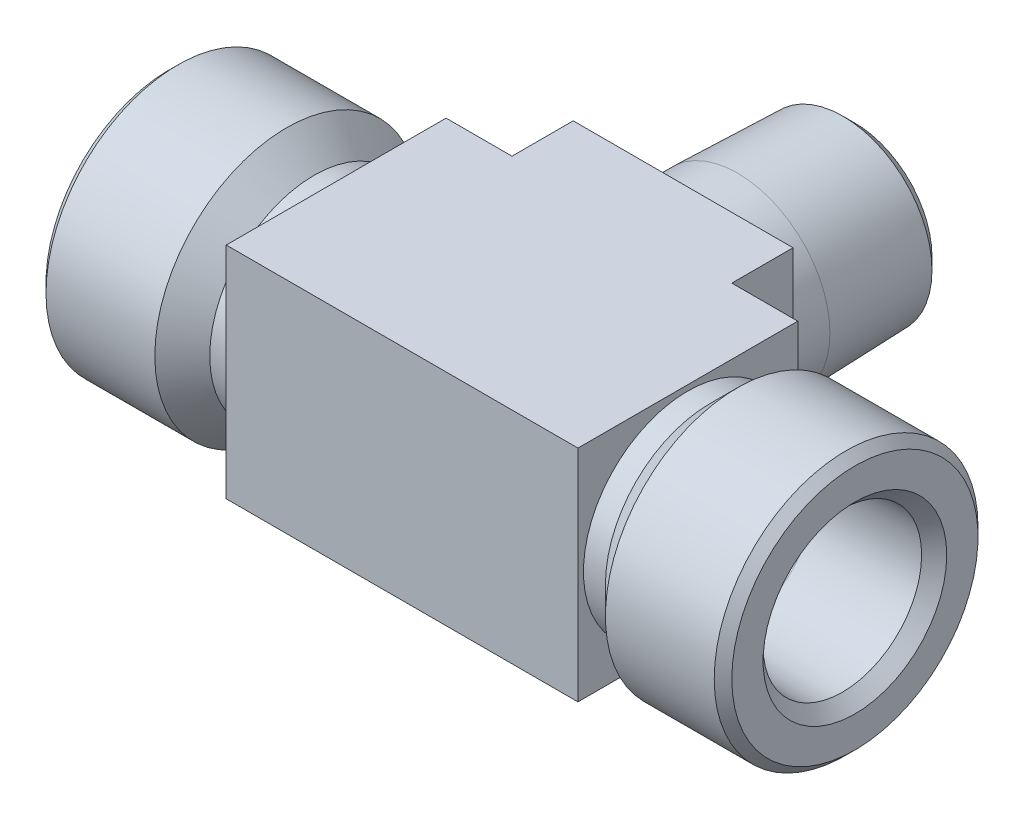
ISO-10303-21;
HEADER;
FILE_DESCRIPTION(('STEP AP214'),'2;1');
FILE_NAME('part.step','',(''),(''),'','','');
FILE_SCHEMA(('AUTOMOTIVE_DESIGN { 1 0 10303 214 1 1 1 1 }'));
ENDSEC;
DATA;
#1=APPLICATION_CONTEXT('core data for automotive mechanical design processes');
#2=APPLICATION_PROTOCOL_DEFINITION('international standard','automotive_design',2000,#1);
#3=PRODUCT_CONTEXT('',#1,'mechanical');
#4=PRODUCT('Part','Part','',(#3));
#5=PRODUCT_RELATED_PRODUCT_CATEGORY('part','',(#4));
#6=PRODUCT_DEFINITION_FORMATION('','',#4);
#7=PRODUCT_DEFINITION_CONTEXT('part definition',#1,'design');
#8=PRODUCT_DEFINITION('design','',#6,#7);
#9=PRODUCT_DEFINITION_SHAPE('','',#8);
#10=(LENGTH_UNIT() NAMED_UNIT(*) SI_UNIT(.MILLI.,.METRE.));
#11=(NAMED_UNIT(*) PLANE_ANGLE_UNIT() SI_UNIT($,.RADIAN.));
#12=(NAMED_UNIT(*) SI_UNIT($,.STERADIAN.) SOLID_ANGLE_UNIT());
#13=UNCERTAINTY_MEASURE_WITH_UNIT(LENGTH_MEASURE(1.E-05),#10,'distance_accuracy_value','');
#14=(GEOMETRIC_REPRESENTATION_CONTEXT(3) GLOBAL_UNCERTAINTY_ASSIGNED_CONTEXT((#13)) GLOBAL_UNIT_ASSIGNED_CONTEXT((#10,
#11,#12)) REPRESENTATION_CONTEXT('',''));
#15=CARTESIAN_POINT('',(0.,0.,0.));
#16=DIRECTION('',(0.,0.,1.));
#17=DIRECTION('',(1.,0.,0.));
#18=AXIS2_PLACEMENT_3D('',#15,#16,#17);
#19=CARTESIAN_POINT('',(19.304,12.7,-12.7));
#20=DIRECTION('',(0.,0.,-1.));
#21=DIRECTION('',(-1.,0.,0.));
#22=AXIS2_PLACEMENT_3D('',#19,#20,#21);
#23=PLANE('',#22);
#24=DIRECTION('',(0.,1.,0.));
#25=VECTOR('',#24,1.);
#26=CARTESIAN_POINT('',(19.304,0.,-12.7));
#27=LINE('',#26,#25);
#28=CARTESIAN_POINT('',(19.304,12.7,-12.7));
#29=VERTEX_POINT('',#28);
#30=CARTESIAN_POINT('',(19.304,-12.7,-12.7));
#31=VERTEX_POINT('',#30);
#32=EDGE_CURVE('E123',#29,#31,#27,.F.);
#33=ORIENTED_EDGE('',*,*,#32,.F.);
#34=DIRECTION('',(1.,0.,0.));
#35=VECTOR('',#34,1.);
#36=CARTESIAN_POINT('',(19.304,12.7,-12.7));
#37=LINE('',#36,#35);
#38=CARTESIAN_POINT('',(26.924,12.7,-12.7));
#39=VERTEX_POINT('',#38);
#40=EDGE_CURVE('E207',#39,#29,#37,.F.);
#41=ORIENTED_EDGE('',*,*,#40,.F.);
#42=DIRECTION('',(0.,1.,0.));
#43=VECTOR('',#42,1.);
#44=CARTESIAN_POINT('',(26.924,12.7,-12.7));
#45=LINE('',#44,#43);
#46=CARTESIAN_POINT('',(26.924,-12.7,-12.7));
#47=VERTEX_POINT('',#46);
#48=EDGE_CURVE('E209',#47,#39,#45,.T.);
#49=ORIENTED_EDGE('',*,*,#48,.F.);
#50=DIRECTION('',(1.,0.,0.));
#51=VECTOR('',#50,1.);
#52=CARTESIAN_POINT('',(19.304,-12.7,-12.7));
#53=LINE('',#52,#51);
#54=EDGE_CURVE('E214',#31,#47,#53,.T.);
#55=ORIENTED_EDGE('',*,*,#54,.F.);
#56=EDGE_LOOP('',(#33,#41,#49,#55));
#57=FACE_BOUND('',#56,.T.);
#58=ADVANCED_FACE('F16',(#57),#23,.T.);
#59=CARTESIAN_POINT('',(19.304,0.,-6.35));
#60=DIRECTION('',(-1.,0.,0.));
#61=DIRECTION('',(0.,0.,1.));
#62=AXIS2_PLACEMENT_3D('',#59,#60,#61);
#63=PLANE('',#62);
#64=DIRECTION('',(0.,0.,1.));
#65=VECTOR('',#64,1.);
#66=CARTESIAN_POINT('',(19.304,12.7,12.7));
#67=LINE('',#66,#65);
#68=CARTESIAN_POINT('',(19.304,12.7,12.7));
#69=VERTEX_POINT('',#68);
#70=EDGE_CURVE('E205',#29,#69,#67,.T.);
#71=ORIENTED_EDGE('',*,*,#70,.F.);
#72=ORIENTED_EDGE('',*,*,#32,.T.);
#73=DIRECTION('',(0.,0.,1.));
#74=VECTOR('',#73,1.);
#75=CARTESIAN_POINT('',(19.304,-12.7,-12.7));
#76=LINE('',#75,#74);
#77=CARTESIAN_POINT('',(19.304,-12.7,12.7));
#78=VERTEX_POINT('',#77);
#79=EDGE_CURVE('E108',#78,#31,#76,.F.);
#80=ORIENTED_EDGE('',*,*,#79,.F.);
#81=DIRECTION('',(0.,-1.,0.));
#82=VECTOR('',#81,1.);
#83=CARTESIAN_POINT('',(19.304,-12.7,12.7));
#84=LINE('',#83,#82);
#85=EDGE_CURVE('E121',#69,#78,#84,.T.);
#86=ORIENTED_EDGE('',*,*,#85,.F.);
#87=EDGE_LOOP('',(#71,#72,#80,#86));
#88=FACE_BOUND('',#87,.T.);
#89=CARTESIAN_POINT('',(19.304,0.,0.));
#90=DIRECTION('',(-1.,0.,0.));
#91=DIRECTION('',(0.,0.,1.));
#92=AXIS2_PLACEMENT_3D('',#89,#90,#91);
#93=CIRCLE('',#92,12.065);
#94=CARTESIAN_POINT('',(19.304,0.,12.065));
#95=VERTEX_POINT('',#94);
#96=EDGE_CURVE('E102',#95,#95,#93,.T.);
#97=ORIENTED_EDGE('',*,*,#96,.F.);
#98=EDGE_LOOP('',(#97));
#99=FACE_BOUND('',#98,.T.);
#100=ADVANCED_FACE('F278',(#88,#99),#63,.T.);
#101=CARTESIAN_POINT('',(19.304,-12.7,12.7));
#102=DIRECTION('',(0.,0.,1.));
#103=DIRECTION('',(0.,-1.,0.));
#104=AXIS2_PLACEMENT_3D('',#101,#102,#103);
#105=PLANE('',#104);
#106=DIRECTION('',(0.,1.,0.));
#107=VECTOR('',#106,1.);
#108=CARTESIAN_POINT('',(59.944,0.,12.7));
#109=LINE('',#108,#107);
#110=CARTESIAN_POINT('',(59.944,12.7,12.7));
#111=VERTEX_POINT('',#110);
#112=CARTESIAN_POINT('',(59.944,-12.7,12.7));
#113=VERTEX_POINT('',#112);
#114=EDGE_CURVE('E79',#111,#113,#109,.F.);
#115=ORIENTED_EDGE('',*,*,#114,.F.);
#116=DIRECTION('',(1.,0.,0.));
#117=VECTOR('',#116,1.);
#118=CARTESIAN_POINT('',(19.304,12.7,12.7));
#119=LINE('',#118,#117);
#120=EDGE_CURVE('E203',#69,#111,#119,.T.);
#121=ORIENTED_EDGE('',*,*,#120,.F.);
#122=ORIENTED_EDGE('',*,*,#85,.T.);
#123=DIRECTION('',(1.,0.,0.));
#124=VECTOR('',#123,1.);
#125=CARTESIAN_POINT('',(19.304,-12.7,12.7));
#126=LINE('',#125,#124);
#127=EDGE_CURVE('E106',#113,#78,#126,.F.);
#128=ORIENTED_EDGE('',*,*,#127,.F.);
#129=EDGE_LOOP('',(#115,#121,#122,#128));
#130=FACE_BOUND('',#129,.T.);
#131=ADVANCED_FACE('F276',(#130),#105,.T.);
#132=CARTESIAN_POINT('',(59.944,0.,-6.35));
#133=DIRECTION('',(1.,0.,0.));
#134=DIRECTION('',(0.,1.,0.));
#135=AXIS2_PLACEMENT_3D('',#132,#133,#134);
#136=PLANE('',#135);
#137=DIRECTION('',(0.,0.,1.));
#138=VECTOR('',#137,1.);
#139=CARTESIAN_POINT('',(59.944,-12.7,-12.7));
#140=LINE('',#139,#138);
#141=CARTESIAN_POINT('',(59.944,-12.7,-12.7));
#142=VERTEX_POINT('',#141);
#143=EDGE_CURVE('E98',#142,#113,#140,.T.);
#144=ORIENTED_EDGE('',*,*,#143,.F.);
#145=DIRECTION('',(0.,1.,0.));
#146=VECTOR('',#145,1.);
#147=CARTESIAN_POINT('',(59.944,12.7,-12.7));
#148=LINE('',#147,#146);
#149=CARTESIAN_POINT('',(59.944,12.7,-12.7));
#150=VERTEX_POINT('',#149);
#151=EDGE_CURVE('E86',#150,#142,#148,.F.);
#152=ORIENTED_EDGE('',*,*,#151,.F.);
#153=DIRECTION('',(0.,0.,1.));
#154=VECTOR('',#153,1.);
#155=CARTESIAN_POINT('',(59.944,12.7,12.7));
#156=LINE('',#155,#154);
#157=EDGE_CURVE('E201',#111,#150,#156,.F.);
#158=ORIENTED_EDGE('',*,*,#157,.F.);
#159=ORIENTED_EDGE('',*,*,#114,.T.);
#160=EDGE_LOOP('',(#144,#152,#158,#159));
#161=FACE_BOUND('',#160,.T.);
#162=CARTESIAN_POINT('',(59.944,0.,0.));
#163=DIRECTION('',(1.,0.,0.));
#164=DIRECTION('',(0.,0.,-1.));
#165=AXIS2_PLACEMENT_3D('',#162,#163,#164);
#166=CIRCLE('',#165,12.065);
#167=CARTESIAN_POINT('',(59.944,0.,-12.065));
#168=VERTEX_POINT('',#167);
#169=EDGE_CURVE('E19',#168,#168,#166,.T.);
#170=ORIENTED_EDGE('',*,*,#169,.F.);
#171=EDGE_LOOP('',(#170));
#172=FACE_BOUND('',#171,.T.);
#173=ADVANCED_FACE('F104',(#161,#172),#136,.T.);
#174=CARTESIAN_POINT('',(19.304,12.7,-12.7));
#175=DIRECTION('',(0.,0.,-1.));
#176=DIRECTION('',(-1.,0.,0.));
#177=AXIS2_PLACEMENT_3D('',#174,#175,#176);
#178=PLANE('',#177);
#179=ORIENTED_EDGE('',*,*,#151,.T.);
#180=DIRECTION('',(1.,0.,0.));
#181=VECTOR('',#180,1.);
#182=CARTESIAN_POINT('',(19.304,-12.7,-12.7));
#183=LINE('',#182,#181);
#184=CARTESIAN_POINT('',(52.324,-12.7,-12.7));
#185=VERTEX_POINT('',#184);
#186=EDGE_CURVE('E90',#185,#142,#183,.T.);
#187=ORIENTED_EDGE('',*,*,#186,.F.);
#188=DIRECTION('',(0.,1.,0.));
#189=VECTOR('',#188,1.);
#190=CARTESIAN_POINT('',(52.324,-12.7,-12.7));
#191=LINE('',#190,#189);
#192=CARTESIAN_POINT('',(52.324,12.7,-12.7));
#193=VERTEX_POINT('',#192);
#194=EDGE_CURVE('E195',#193,#185,#191,.F.);
#195=ORIENTED_EDGE('',*,*,#194,.F.);
#196=DIRECTION('',(1.,0.,0.));
#197=VECTOR('',#196,1.);
#198=CARTESIAN_POINT('',(19.304,12.7,-12.7));
#199=LINE('',#198,#197);
#200=EDGE_CURVE('E92',#150,#193,#199,.F.);
#201=ORIENTED_EDGE('',*,*,#200,.F.);
#202=EDGE_LOOP('',(#179,#187,#195,#201));
#203=FACE_BOUND('',#202,.T.);
#204=ADVANCED_FACE('F88',(#203),#178,.T.);
#205=CARTESIAN_POINT('',(61.214,0.,0.));
#206=DIRECTION('',(1.,0.,0.));
#207=DIRECTION('',(0.,0.,-1.));
#208=AXIS2_PLACEMENT_3D('',#205,#206,#207);
#209=CYLINDRICAL_SURFACE('',#208,12.065);
#210=ORIENTED_EDGE('',*,*,#169,.T.);
#211=EDGE_LOOP('',(#210));
#212=FACE_BOUND('',#211,.T.);
#213=CARTESIAN_POINT('',(62.484,0.,0.));
#214=DIRECTION('',(1.,0.,0.));
#215=DIRECTION('',(0.,0.,1.));
#216=AXIS2_PLACEMENT_3D('',#213,#214,#215);
#217=CIRCLE('',#216,12.065);
#218=CARTESIAN_POINT('',(62.484,0.,12.065));
#219=VERTEX_POINT('',#218);
#220=EDGE_CURVE('E116',#219,#219,#217,.F.);
#221=ORIENTED_EDGE('',*,*,#220,.T.);
#222=EDGE_LOOP('',(#221));
#223=FACE_BOUND('',#222,.T.);
#224=ADVANCED_FACE('F267',(#212,#223),#209,.T.);
#225=CARTESIAN_POINT('',(18.034,0.,0.));
#226=DIRECTION('',(-1.,0.,0.));
#227=DIRECTION('',(0.,0.,1.));
#228=AXIS2_PLACEMENT_3D('',#225,#226,#227);
#229=CYLINDRICAL_SURFACE('',#228,12.065);
#230=ORIENTED_EDGE('',*,*,#96,.T.);
#231=EDGE_LOOP('',(#230));
#232=FACE_BOUND('',#231,.T.);
#233=CARTESIAN_POINT('',(16.764,0.,0.));
#234=DIRECTION('',(-1.,0.,0.));
#235=DIRECTION('',(0.,0.,-1.));
#236=AXIS2_PLACEMENT_3D('',#233,#234,#235);
#237=CIRCLE('',#236,12.065);
#238=CARTESIAN_POINT('',(16.764,0.,-12.065));
#239=VERTEX_POINT('',#238);
#240=EDGE_CURVE('E112',#239,#239,#237,.F.);
#241=ORIENTED_EDGE('',*,*,#240,.T.);
#242=EDGE_LOOP('',(#241));
#243=FACE_BOUND('',#242,.T.);
#244=ADVANCED_FACE('F264',(#232,#243),#229,.T.);
#245=CARTESIAN_POINT('',(19.304,-12.7,-12.7));
#246=DIRECTION('',(0.,-1.,0.));
#247=DIRECTION('',(1.,0.,0.));
#248=AXIS2_PLACEMENT_3D('',#245,#246,#247);
#249=PLANE('',#248);
#250=ORIENTED_EDGE('',*,*,#79,.T.);
#251=ORIENTED_EDGE('',*,*,#54,.T.);
#252=DIRECTION('',(0.,0.,1.));
#253=VECTOR('',#252,1.);
#254=CARTESIAN_POINT('',(26.924,-12.7,0.));
#255=LINE('',#254,#253);
#256=CARTESIAN_POINT('',(26.924,-12.7,-19.7739));
#257=VERTEX_POINT('',#256);
#258=EDGE_CURVE('E211',#257,#47,#255,.T.);
#259=ORIENTED_EDGE('',*,*,#258,.F.);
#260=DIRECTION('',(-1.,0.,0.));
#261=VECTOR('',#260,1.);
#262=CARTESIAN_POINT('',(45.974,-12.7,-19.7739));
#263=LINE('',#262,#261);
#264=CARTESIAN_POINT('',(52.324,-12.7,-19.7739));
#265=VERTEX_POINT('',#264);
#266=EDGE_CURVE('E115',#265,#257,#263,.T.);
#267=ORIENTED_EDGE('',*,*,#266,.F.);
#268=DIRECTION('',(0.,0.,-1.));
#269=VECTOR('',#268,1.);
#270=CARTESIAN_POINT('',(52.324,-12.7,0.));
#271=LINE('',#270,#269);
#272=EDGE_CURVE('E101',#185,#265,#271,.T.);
#273=ORIENTED_EDGE('',*,*,#272,.F.);
#274=ORIENTED_EDGE('',*,*,#186,.T.);
#275=ORIENTED_EDGE('',*,*,#143,.T.);
#276=ORIENTED_EDGE('',*,*,#127,.T.);
#277=EDGE_LOOP('',(#250,#251,#259,#267,#273,#274,#275,#276));
#278=FACE_BOUND('',#277,.T.);
#279=ADVANCED_FACE('F96',(#278),#249,.T.);
#280=CARTESIAN_POINT('',(26.924,12.7,0.));
#281=DIRECTION('',(-1.,0.,0.));
#282=DIRECTION('',(0.,0.,1.));
#283=AXIS2_PLACEMENT_3D('',#280,#281,#282);
#284=PLANE('',#283);
#285=ORIENTED_EDGE('',*,*,#48,.T.);
#286=DIRECTION('',(0.,0.,1.));
#287=VECTOR('',#286,1.);
#288=CARTESIAN_POINT('',(26.924,12.7,12.7));
#289=LINE('',#288,#287);
#290=CARTESIAN_POINT('',(26.924,12.7,-19.7739));
#291=VERTEX_POINT('',#290);
#292=EDGE_CURVE('E197',#291,#39,#289,.T.);
#293=ORIENTED_EDGE('',*,*,#292,.F.);
#294=DIRECTION('',(0.,1.,0.));
#295=VECTOR('',#294,1.);
#296=CARTESIAN_POINT('',(26.924,0.,-19.7739));
#297=LINE('',#296,#295);
#298=EDGE_CURVE('E184',#257,#291,#297,.T.);
#299=ORIENTED_EDGE('',*,*,#298,.F.);
#300=ORIENTED_EDGE('',*,*,#258,.T.);
#301=EDGE_LOOP('',(#285,#293,#299,#300));
#302=FACE_BOUND('',#301,.T.);
#303=ADVANCED_FACE('F227',(#302),#284,.T.);
#304=CARTESIAN_POINT('',(19.304,12.7,12.7));
#305=DIRECTION('',(0.,1.,0.));
#306=DIRECTION('',(0.,0.,1.));
#307=AXIS2_PLACEMENT_3D('',#304,#305,#306);
#308=PLANE('',#307);
#309=DIRECTION('',(-1.,0.,0.));
#310=VECTOR('',#309,1.);
#311=CARTESIAN_POINT('',(45.974,12.7,-19.7739));
#312=LINE('',#311,#310);
#313=CARTESIAN_POINT('',(52.324,12.7,-19.7739));
#314=VERTEX_POINT('',#313);
#315=EDGE_CURVE('E34',#291,#314,#312,.F.);
#316=ORIENTED_EDGE('',*,*,#315,.F.);
#317=ORIENTED_EDGE('',*,*,#292,.T.);
#318=ORIENTED_EDGE('',*,*,#40,.T.);
#319=ORIENTED_EDGE('',*,*,#70,.T.);
#320=ORIENTED_EDGE('',*,*,#120,.T.);
#321=ORIENTED_EDGE('',*,*,#157,.T.);
#322=ORIENTED_EDGE('',*,*,#200,.T.);
#323=DIRECTION('',(0.,0.,-1.));
#324=VECTOR('',#323,1.);
#325=CARTESIAN_POINT('',(52.324,12.7,0.));
#326=LINE('',#325,#324);
#327=EDGE_CURVE('E118',#314,#193,#326,.F.);
#328=ORIENTED_EDGE('',*,*,#327,.F.);
#329=EDGE_LOOP('',(#316,#317,#318,#319,#320,#321,#322,#328));
#330=FACE_BOUND('',#329,.T.);
#331=ADVANCED_FACE('F230',(#330),#308,.T.);
#332=CARTESIAN_POINT('',(52.324,-12.7,0.));
#333=DIRECTION('',(1.,0.,0.));
#334=DIRECTION('',(0.,0.,-1.));
#335=AXIS2_PLACEMENT_3D('',#332,#333,#334);
#336=PLANE('',#335);
#337=DIRECTION('',(0.,1.,0.));
#338=VECTOR('',#337,1.);
#339=CARTESIAN_POINT('',(52.324,0.,-19.7739));
#340=LINE('',#339,#338);
#341=EDGE_CURVE('E180',#314,#265,#340,.F.);
#342=ORIENTED_EDGE('',*,*,#341,.F.);
#343=ORIENTED_EDGE('',*,*,#327,.T.);
#344=ORIENTED_EDGE('',*,*,#194,.T.);
#345=ORIENTED_EDGE('',*,*,#272,.T.);
#346=EDGE_LOOP('',(#342,#343,#344,#345));
#347=FACE_BOUND('',#346,.T.);
#348=ADVANCED_FACE('F233',(#347),#336,.T.);
#349=CARTESIAN_POINT('',(62.484,0.,0.));
#350=DIRECTION('',(1.,0.,0.));
#351=DIRECTION('',(0.,1.,0.));
#352=AXIS2_PLACEMENT_3D('',#349,#350,#351);
#353=CONICAL_SURFACE('',#352,12.065,0.785398163397448);
#354=ORIENTED_EDGE('',*,*,#220,.F.);
#355=EDGE_LOOP('',(#354));
#356=FACE_BOUND('',#355,.T.);
#357=CARTESIAN_POINT('',(65.659,0.,0.));
#358=DIRECTION('',(1.,0.,0.));
#359=DIRECTION('',(0.,0.,-1.));
#360=AXIS2_PLACEMENT_3D('',#357,#358,#359);
#361=CIRCLE('',#360,15.24);
#362=CARTESIAN_POINT('',(65.659,0.,-15.24));
#363=VERTEX_POINT('',#362);
#364=EDGE_CURVE('E182',#363,#363,#361,.T.);
#365=ORIENTED_EDGE('',*,*,#364,.F.);
#366=EDGE_LOOP('',(#365));
#367=FACE_BOUND('',#366,.T.);
#368=ADVANCED_FACE('F247',(#356,#367),#353,.T.);
#369=CARTESIAN_POINT('',(16.764,0.,0.));
#370=DIRECTION('',(-1.,0.,0.));
#371=DIRECTION('',(0.,0.,1.));
#372=AXIS2_PLACEMENT_3D('',#369,#370,#371);
#373=CONICAL_SURFACE('',#372,12.065,0.785398163397448);
#374=ORIENTED_EDGE('',*,*,#240,.F.);
#375=EDGE_LOOP('',(#374));
#376=FACE_BOUND('',#375,.T.);
#377=CARTESIAN_POINT('',(13.589,0.,0.));
#378=DIRECTION('',(-1.,0.,0.));
#379=DIRECTION('',(0.,0.,1.));
#380=AXIS2_PLACEMENT_3D('',#377,#378,#379);
#381=CIRCLE('',#380,15.24);
#382=CARTESIAN_POINT('',(13.589,0.,15.24));
#383=VERTEX_POINT('',#382);
#384=EDGE_CURVE('E187',#383,#383,#381,.T.);
#385=ORIENTED_EDGE('',*,*,#384,.F.);
#386=EDGE_LOOP('',(#385));
#387=FACE_BOUND('',#386,.T.);
#388=ADVANCED_FACE('F237',(#376,#387),#373,.T.);
#389=CARTESIAN_POINT('',(45.974,0.,-19.7739));
#390=DIRECTION('',(0.,0.,-1.));
#391=DIRECTION('',(-1.,0.,0.));
#392=AXIS2_PLACEMENT_3D('',#389,#390,#391);
#393=PLANE('',#392);
#394=CARTESIAN_POINT('',(39.624,0.,-19.7739));
#395=DIRECTION('',(0.,0.,1.));
#396=DIRECTION('',(1.,0.,0.));
#397=AXIS2_PLACEMENT_3D('',#394,#395,#396);
#398=CIRCLE('',#397,10.668);
#399=CARTESIAN_POINT('',(50.292,0.,-19.7739));
#400=VERTEX_POINT('',#399);
#401=EDGE_CURVE('E179',#400,#400,#398,.F.);
#402=ORIENTED_EDGE('',*,*,#401,.F.);
#403=EDGE_LOOP('',(#402));
#404=FACE_BOUND('',#403,.T.);
#405=ORIENTED_EDGE('',*,*,#315,.T.);
#406=ORIENTED_EDGE('',*,*,#341,.T.);
#407=ORIENTED_EDGE('',*,*,#266,.T.);
#408=ORIENTED_EDGE('',*,*,#298,.T.);
#409=EDGE_LOOP('',(#405,#406,#407,#408));
#410=FACE_BOUND('',#409,.T.);
#411=ADVANCED_FACE('F234',(#404,#410),#393,.T.);
#412=CARTESIAN_POINT('',(70.866,0.,0.));
#413=DIRECTION('',(1.,0.,0.));
#414=DIRECTION('',(0.,0.,-1.));
#415=AXIS2_PLACEMENT_3D('',#412,#413,#414);
#416=CYLINDRICAL_SURFACE('',#415,15.24);
#417=ORIENTED_EDGE('',*,*,#364,.T.);
#418=EDGE_LOOP('',(#417));
#419=FACE_BOUND('',#418,.T.);
#420=CARTESIAN_POINT('',(78.232,0.,0.));
#421=DIRECTION('',(-1.,0.,0.));
#422=DIRECTION('',(0.,0.,-1.));
#423=AXIS2_PLACEMENT_3D('',#420,#421,#422);
#424=CIRCLE('',#423,15.24);
#425=CARTESIAN_POINT('',(78.232,0.,-15.24));
#426=VERTEX_POINT('',#425);
#427=EDGE_CURVE('E176',#426,#426,#424,.T.);
#428=ORIENTED_EDGE('',*,*,#427,.T.);
#429=EDGE_LOOP('',(#428));
#430=FACE_BOUND('',#429,.T.);
#431=ADVANCED_FACE('F236',(#419,#430),#416,.T.);
#432=CARTESIAN_POINT('',(8.382,0.,0.));
#433=DIRECTION('',(-1.,0.,0.));
#434=DIRECTION('',(0.,0.,1.));
#435=AXIS2_PLACEMENT_3D('',#432,#433,#434);
#436=CYLINDRICAL_SURFACE('',#435,15.24);
#437=ORIENTED_EDGE('',*,*,#384,.T.);
#438=EDGE_LOOP('',(#437));
#439=FACE_BOUND('',#438,.T.);
#440=CARTESIAN_POINT('',(1.016,0.,0.));
#441=DIRECTION('',(1.,0.,0.));
#442=DIRECTION('',(0.,0.,1.));
#443=AXIS2_PLACEMENT_3D('',#440,#441,#442);
#444=CIRCLE('',#443,15.24);
#445=CARTESIAN_POINT('',(1.016,0.,15.24));
#446=VERTEX_POINT('',#445);
#447=EDGE_CURVE('E173',#446,#446,#444,.T.);
#448=ORIENTED_EDGE('',*,*,#447,.T.);
#449=EDGE_LOOP('',(#448));
#450=FACE_BOUND('',#449,.T.);
#451=ADVANCED_FACE('F244',(#439,#450),#436,.T.);
#452=CARTESIAN_POINT('',(39.624,0.,-22.92096));
#453=DIRECTION('',(0.,0.,1.));
#454=DIRECTION('',(1.,0.,0.));
#455=AXIS2_PLACEMENT_3D('',#452,#453,#454);
#456=CYLINDRICAL_SURFACE('',#455,10.668);
#457=CARTESIAN_POINT('',(39.624,0.,-26.06802));
#458=DIRECTION('',(0.,0.,1.));
#459=DIRECTION('',(-1.,0.,0.));
#460=AXIS2_PLACEMENT_3D('',#457,#458,#459);
#461=CIRCLE('',#460,10.668);
#462=CARTESIAN_POINT('',(28.956,0.,-26.0680199999999));
#463=VERTEX_POINT('',#462);
#464=EDGE_CURVE('E169',#463,#463,#461,.F.);
#465=ORIENTED_EDGE('',*,*,#464,.F.);
#466=EDGE_LOOP('',(#465));
#467=FACE_BOUND('',#466,.T.);
#468=ORIENTED_EDGE('',*,*,#401,.T.);
#469=EDGE_LOOP('',(#468));
#470=FACE_BOUND('',#469,.T.);
#471=ADVANCED_FACE('F321',(#467,#470),#456,.T.);
#472=CARTESIAN_POINT('',(79.248,0.,0.));
#473=DIRECTION('',(-1.,0.,0.));
#474=DIRECTION('',(0.,0.,1.));
#475=AXIS2_PLACEMENT_3D('',#472,#473,#474);
#476=CONICAL_SURFACE('',#475,14.224,0.785398163397448);
#477=CARTESIAN_POINT('',(79.248,0.,0.));
#478=DIRECTION('',(-1.,0.,0.));
#479=DIRECTION('',(0.,0.,1.));
#480=AXIS2_PLACEMENT_3D('',#477,#478,#479);
#481=CIRCLE('',#480,14.224);
#482=CARTESIAN_POINT('',(79.248,0.,14.224));
#483=VERTEX_POINT('',#482);
#484=EDGE_CURVE('E172',#483,#483,#481,.F.);
#485=ORIENTED_EDGE('',*,*,#484,.F.);
#486=EDGE_LOOP('',(#485));
#487=FACE_BOUND('',#486,.T.);
#488=ORIENTED_EDGE('',*,*,#427,.F.);
#489=EDGE_LOOP('',(#488));
#490=FACE_BOUND('',#489,.T.);
#491=ADVANCED_FACE('F324',(#487,#490),#476,.T.);
#492=CARTESIAN_POINT('',(0.,0.,0.));
#493=DIRECTION('',(1.,0.,0.));
#494=DIRECTION('',(0.,0.,-1.));
#495=AXIS2_PLACEMENT_3D('',#492,#493,#494);
#496=CONICAL_SURFACE('',#495,14.224,0.785398163397449);
#497=CARTESIAN_POINT('',(0.,0.,0.));
#498=DIRECTION('',(1.,0.,0.));
#499=DIRECTION('',(0.,0.,-1.));
#500=AXIS2_PLACEMENT_3D('',#497,#498,#499);
#501=CIRCLE('',#500,14.224);
#502=CARTESIAN_POINT('',(0.,0.,-14.224));
#503=VERTEX_POINT('',#502);
#504=EDGE_CURVE('E168',#503,#503,#501,.F.);
#505=ORIENTED_EDGE('',*,*,#504,.F.);
#506=EDGE_LOOP('',(#505));
#507=FACE_BOUND('',#506,.T.);
#508=ORIENTED_EDGE('',*,*,#447,.F.);
#509=EDGE_LOOP('',(#508));
#510=FACE_BOUND('',#509,.T.);
#511=ADVANCED_FACE('F317',(#507,#510),#496,.T.);
#512=CARTESIAN_POINT('',(39.624,0.,-26.0680199999999));
#513=DIRECTION('',(0.,0.,1.));
#514=DIRECTION('',(1.,0.,0.));
#515=AXIS2_PLACEMENT_3D('',#512,#513,#514);
#516=CONICAL_SURFACE('',#515,10.668,0.0311250383214153);
#517=CARTESIAN_POINT('',(39.624,0.,-38.2415334766456));
#518=DIRECTION('',(0.,0.,1.));
#519=DIRECTION('',(-1.,0.,0.));
#520=AXIS2_PLACEMENT_3D('',#517,#518,#519);
#521=CIRCLE('',#520,10.2889765233544);
#522=CARTESIAN_POINT('',(29.3350234766456,0.,-38.2415334766456));
#523=VERTEX_POINT('',#522);
#524=EDGE_CURVE('E164',#523,#523,#521,.T.);
#525=ORIENTED_EDGE('',*,*,#524,.T.);
#526=EDGE_LOOP('',(#525));
#527=FACE_BOUND('',#526,.T.);
#528=ORIENTED_EDGE('',*,*,#464,.T.);
#529=EDGE_LOOP('',(#528));
#530=FACE_BOUND('',#529,.T.);
#531=ADVANCED_FACE('F313',(#527,#530),#516,.T.);
#532=CARTESIAN_POINT('',(79.248,0.,7.62));
#533=DIRECTION('',(1.,0.,0.));
#534=DIRECTION('',(0.,0.,-1.));
#535=AXIS2_PLACEMENT_3D('',#532,#533,#534);
#536=PLANE('',#535);
#537=CARTESIAN_POINT('',(79.248,0.,0.));
#538=DIRECTION('',(1.,0.,0.));
#539=DIRECTION('',(0.,0.,-1.));
#540=AXIS2_PLACEMENT_3D('',#537,#538,#539);
#541=CIRCLE('',#540,10.611739);
#542=CARTESIAN_POINT('',(79.248,0.,-10.611739));
#543=VERTEX_POINT('',#542);
#544=EDGE_CURVE('E167',#543,#543,#541,.F.);
#545=ORIENTED_EDGE('',*,*,#544,.T.);
#546=EDGE_LOOP('',(#545));
#547=FACE_BOUND('',#546,.T.);
#548=ORIENTED_EDGE('',*,*,#484,.T.);
#549=EDGE_LOOP('',(#548));
#550=FACE_BOUND('',#549,.T.);
#551=ADVANCED_FACE('F316',(#547,#550),#536,.T.);
#552=CARTESIAN_POINT('',(0.,0.,-7.62));
#553=DIRECTION('',(-1.,0.,0.));
#554=DIRECTION('',(0.,0.,1.));
#555=AXIS2_PLACEMENT_3D('',#552,#553,#554);
#556=PLANE('',#555);
#557=CARTESIAN_POINT('',(0.,0.,0.));
#558=DIRECTION('',(-1.,0.,0.));
#559=DIRECTION('',(0.,0.,1.));
#560=AXIS2_PLACEMENT_3D('',#557,#558,#559);
#561=CIRCLE('',#560,10.611739);
#562=CARTESIAN_POINT('',(0.,0.,10.611739));
#563=VERTEX_POINT('',#562);
#564=EDGE_CURVE('E297',#563,#563,#561,.F.);
#565=ORIENTED_EDGE('',*,*,#564,.T.);
#566=EDGE_LOOP('',(#565));
#567=FACE_BOUND('',#566,.T.);
#568=ORIENTED_EDGE('',*,*,#504,.T.);
#569=EDGE_LOOP('',(#568));
#570=FACE_BOUND('',#569,.T.);
#571=ADVANCED_FACE('F309',(#567,#570),#556,.T.);
#572=CARTESIAN_POINT('',(39.624,0.,-39.624));
#573=DIRECTION('',(0.,0.,1.));
#574=DIRECTION('',(1.,0.,0.));
#575=AXIS2_PLACEMENT_3D('',#572,#573,#574);
#576=CONICAL_SURFACE('',#575,8.90650999999998,0.785398163397446);
#577=CARTESIAN_POINT('',(39.624,0.,-39.624));
#578=DIRECTION('',(0.,0.,1.));
#579=DIRECTION('',(1.,0.,0.));
#580=AXIS2_PLACEMENT_3D('',#577,#578,#579);
#581=CIRCLE('',#580,8.90650999999999);
#582=CARTESIAN_POINT('',(48.53051,0.,-39.624));
#583=VERTEX_POINT('',#582);
#584=EDGE_CURVE('E163',#583,#583,#581,.F.);
#585=ORIENTED_EDGE('',*,*,#584,.F.);
#586=EDGE_LOOP('',(#585));
#587=FACE_BOUND('',#586,.T.);
#588=ORIENTED_EDGE('',*,*,#524,.F.);
#589=EDGE_LOOP('',(#588));
#590=FACE_BOUND('',#589,.T.);
#591=ADVANCED_FACE('F305',(#587,#590),#576,.T.);
#592=CARTESIAN_POINT('',(79.248,0.,0.));
#593=DIRECTION('',(1.,0.,0.));
#594=DIRECTION('',(0.,0.,-1.));
#595=AXIS2_PLACEMENT_3D('',#592,#593,#594);
#596=CONICAL_SURFACE('',#595,10.611739,0.785398163397448);
#597=ORIENTED_EDGE('',*,*,#544,.F.);
#598=EDGE_LOOP('',(#597));
#599=FACE_BOUND('',#598,.T.);
#600=CARTESIAN_POINT('',(77.796644,0.,0.));
#601=DIRECTION('',(1.,0.,0.));
#602=DIRECTION('',(0.,0.,1.));
#603=AXIS2_PLACEMENT_3D('',#600,#601,#602);
#604=CIRCLE('',#603,9.160383);
#605=CARTESIAN_POINT('',(77.796644,0.,9.160383));
#606=VERTEX_POINT('',#605);
#607=EDGE_CURVE('E160',#606,#606,#604,.F.);
#608=ORIENTED_EDGE('',*,*,#607,.T.);
#609=EDGE_LOOP('',(#608));
#610=FACE_BOUND('',#609,.T.);
#611=ADVANCED_FACE('F308',(#599,#610),#596,.F.);
#612=CARTESIAN_POINT('',(0.,0.,0.));
#613=DIRECTION('',(-1.,0.,0.));
#614=DIRECTION('',(0.,0.,1.));
#615=AXIS2_PLACEMENT_3D('',#612,#613,#614);
#616=CONICAL_SURFACE('',#615,10.611739,0.785398163397449);
#617=ORIENTED_EDGE('',*,*,#564,.F.);
#618=EDGE_LOOP('',(#617));
#619=FACE_BOUND('',#618,.T.);
#620=CARTESIAN_POINT('',(1.45135600000001,0.,0.));
#621=DIRECTION('',(-1.,0.,0.));
#622=DIRECTION('',(0.,0.,-1.));
#623=AXIS2_PLACEMENT_3D('',#620,#621,#622);
#624=CIRCLE('',#623,9.160383);
#625=CARTESIAN_POINT('',(1.45135600000003,0.,-9.160383));
#626=VERTEX_POINT('',#625);
#627=EDGE_CURVE('E156',#626,#626,#624,.F.);
#628=ORIENTED_EDGE('',*,*,#627,.T.);
#629=EDGE_LOOP('',(#628));
#630=FACE_BOUND('',#629,.T.);
#631=ADVANCED_FACE('F345',(#619,#630),#616,.F.);
#632=CARTESIAN_POINT('',(34.5010333503468,0.,-39.624));
#633=DIRECTION('',(0.,0.,-1.));
#634=DIRECTION('',(-1.,0.,0.));
#635=AXIS2_PLACEMENT_3D('',#632,#633,#634);
#636=PLANE('',#635);
#637=ORIENTED_EDGE('',*,*,#584,.T.);
#638=EDGE_LOOP('',(#637));
#639=FACE_BOUND('',#638,.T.);
#640=CARTESIAN_POINT('',(39.624,0.,-39.624));
#641=DIRECTION('',(0.,0.,-1.));
#642=DIRECTION('',(-1.,0.,0.));
#643=AXIS2_PLACEMENT_3D('',#640,#641,#642);
#644=CIRCLE('',#643,5.969);
#645=CARTESIAN_POINT('',(33.655,0.,-39.624));
#646=VERTEX_POINT('',#645);
#647=EDGE_CURVE('E129',#646,#646,#644,.F.);
#648=ORIENTED_EDGE('',*,*,#647,.T.);
#649=EDGE_LOOP('',(#648));
#650=FACE_BOUND('',#649,.T.);
#651=ADVANCED_FACE('F302',(#639,#650),#636,.T.);
#652=CARTESIAN_POINT('',(77.796644,0.,0.));
#653=DIRECTION('',(1.,0.,0.));
#654=DIRECTION('',(0.,1.,0.));
#655=AXIS2_PLACEMENT_3D('',#652,#653,#654);
#656=CONICAL_SURFACE('',#655,9.160383,0.0256563400043167);
#657=ORIENTED_EDGE('',*,*,#607,.F.);
#658=EDGE_LOOP('',(#657));
#659=FACE_BOUND('',#658,.T.);
#660=CARTESIAN_POINT('',(65.67678,0.,0.));
#661=DIRECTION('',(1.,0.,0.));
#662=DIRECTION('',(0.,0.,-1.));
#663=AXIS2_PLACEMENT_3D('',#660,#661,#662);
#664=CIRCLE('',#663,8.84936340276164);
#665=CARTESIAN_POINT('',(65.67678,0.,-8.84936340276164));
#666=VERTEX_POINT('',#665);
#667=EDGE_CURVE('E151',#666,#666,#664,.F.);
#668=ORIENTED_EDGE('',*,*,#667,.T.);
#669=EDGE_LOOP('',(#668));
#670=FACE_BOUND('',#669,.T.);
#671=ADVANCED_FACE('F352',(#659,#670),#656,.F.);
#672=CARTESIAN_POINT('',(1.45135600000003,0.,0.));
#673=DIRECTION('',(-1.,0.,0.));
#674=DIRECTION('',(0.,0.,1.));
#675=AXIS2_PLACEMENT_3D('',#672,#673,#674);
#676=CONICAL_SURFACE('',#675,9.160383,0.0256563400043167);
#677=ORIENTED_EDGE('',*,*,#627,.F.);
#678=EDGE_LOOP('',(#677));
#679=FACE_BOUND('',#678,.T.);
#680=CARTESIAN_POINT('',(13.57122,0.,0.));
#681=DIRECTION('',(1.,0.,0.));
#682=DIRECTION('',(0.,0.,-1.));
#683=AXIS2_PLACEMENT_3D('',#680,#681,#682);
#684=CIRCLE('',#683,8.84936340276164);
#685=CARTESIAN_POINT('',(13.57122,0.,-8.84936340276164));
#686=VERTEX_POINT('',#685);
#687=EDGE_CURVE('E25',#686,#686,#684,.T.);
#688=ORIENTED_EDGE('',*,*,#687,.T.);
#689=EDGE_LOOP('',(#688));
#690=FACE_BOUND('',#689,.T.);
#691=ADVANCED_FACE('F142',(#679,#690),#676,.F.);
#692=CARTESIAN_POINT('',(39.624,0.,-29.69895));
#693=DIRECTION('',(0.,0.,-1.));
#694=DIRECTION('',(-1.,0.,0.));
#695=AXIS2_PLACEMENT_3D('',#692,#693,#694);
#696=CYLINDRICAL_SURFACE('',#695,5.969);
#697=CARTESIAN_POINT('',(33.655,0.,-8.84936340276164));
#698=CARTESIAN_POINT('',(33.6550010497407,-0.149412195864291,-8.84936240659858));
#699=CARTESIAN_POINT('',(33.6606186574489,-0.298844438144,-8.84557056085226));
#700=CARTESIAN_POINT('',(33.6830077161083,-0.596550767939231,-8.83049229194922));
#701=CARTESIAN_POINT('',(33.6997847645318,-0.7448242364436,-8.8192021076996));
#702=CARTESIAN_POINT('',(33.7442745318537,-1.0392239530072,-8.78937826407328));
#703=CARTESIAN_POINT('',(33.7720047595038,-1.18534637276874,-8.77083300785793));
#704=CARTESIAN_POINT('',(33.8380117351089,-1.47419944132437,-8.72693103813553));
#705=CARTESIAN_POINT('',(33.8762930439904,-1.61692859425842,-8.70157137907888));
#706=CARTESIAN_POINT('',(33.9626403878469,-1.89719218392584,-8.64477943236778));
#707=CARTESIAN_POINT('',(34.0106473078165,-2.03475231910018,-8.61338388870201));
#708=CARTESIAN_POINT('',(34.1160327236673,-2.30484284377991,-8.54507887418182));
#709=CARTESIAN_POINT('',(34.1734148751607,-2.43737124635901,-8.50816725296659));
#710=CARTESIAN_POINT('',(34.3586904562011,-2.82626916310391,-8.39026923935097));
#711=CARTESIAN_POINT('',(34.4998188797828,-3.0742895109636,-8.30204851949013));
#712=CARTESIAN_POINT('',(34.8262953302757,-3.56443374233779,-8.104437539783));
#713=CARTESIAN_POINT('',(35.0144005354353,-3.80422084447112,-7.99387975806055));
#714=CARTESIAN_POINT('',(35.4229848412859,-4.25114470518828,-7.76543546468391));
#715=CARTESIAN_POINT('',(35.6435113192781,-4.45823274608144,-7.64753837597144));
#716=CARTESIAN_POINT('',(36.0151958586872,-4.75775815505123,-7.46269157914069));
#717=CARTESIAN_POINT('',(36.1567446772892,-4.86189859819042,-7.39507595764872));
#718=CARTESIAN_POINT('',(36.449328785284,-5.05781187591269,-7.26249118905015));
#719=CARTESIAN_POINT('',(36.6003663738249,-5.14958169599233,-7.19752268968217));
#720=CARTESIAN_POINT('',(37.0668717843116,-5.40513630939351,-7.01000230046146));
#721=CARTESIAN_POINT('',(37.3963840557577,-5.54969506394713,-6.89449256893739));
#722=CARTESIAN_POINT('',(37.9869812115975,-5.74594851462214,-6.73103542021308));
#723=CARTESIAN_POINT('',(38.2404016873927,-5.81240095660639,-6.67321056608848));
#724=CARTESIAN_POINT('',(38.6284264120609,-5.88686129721407,-6.60735460446265));
#725=CARTESIAN_POINT('',(38.7589247216393,-5.90746883039513,-6.5888923791757));
#726=CARTESIAN_POINT('',(39.0218102694279,-5.94001940286927,-6.55956582284525));
#727=CARTESIAN_POINT('',(39.1541962660698,-5.95196789155536,-6.54869671338463));
#728=CARTESIAN_POINT('',(39.3430564106835,-5.96264968075735,-6.53896426658037));
#729=CARTESIAN_POINT('',(39.3991888553223,-5.9650296329355,-6.53679272132896));
#730=CARTESIAN_POINT('',(39.5115445431396,-5.96820526962659,-6.53389338724208));
#731=CARTESIAN_POINT('',(39.5677677997829,-5.96900069242103,-6.53316583691296));
#732=CARTESIAN_POINT('',(39.7689552529725,-5.96899821507847,-6.53317015818109));
#733=CARTESIAN_POINT('',(39.9139699363728,-5.96370621071299,-6.5380159003974));
#734=CARTESIAN_POINT('',(40.2026768143078,-5.9426491033732,-6.5571600702876));
#735=CARTESIAN_POINT('',(40.3463678875946,-5.92687582460336,-6.57146587713202));
#736=CARTESIAN_POINT('',(40.6314930574459,-5.88512761348161,-6.60887953928602));
#737=CARTESIAN_POINT('',(40.7729200556225,-5.85912539503854,-6.63201093217571));
#738=CARTESIAN_POINT('',(41.0521499706205,-5.79739870591357,-6.68603608803157));
#739=CARTESIAN_POINT('',(41.1899508579621,-5.76166891265,-6.71693409990209));
#740=CARTESIAN_POINT('',(41.5936806264441,-5.64158340306563,-6.81870138266007));
#741=CARTESIAN_POINT('',(41.853329951864,-5.54381412684288,-6.8991402689406));
#742=CARTESIAN_POINT('',(42.3517990402306,-5.31632933781471,-7.07591659939384));
#743=CARTESIAN_POINT('',(42.5906224537313,-5.1866194391546,-7.17225124861644));
#744=CARTESIAN_POINT('',(43.0830058041931,-4.87464205322664,-7.38854234683716));
#745=CARTESIAN_POINT('',(43.3327971039329,-4.68728367496281,-7.50981064201099));
#746=CARTESIAN_POINT('',(43.6834694784198,-4.37880765881866,-7.6910086421365));
#747=CARTESIAN_POINT('',(43.7964430578981,-4.27130685308798,-7.75134121220155));
#748=CARTESIAN_POINT('',(44.0140385833858,-4.04733198628337,-7.87060419761746));
#749=CARTESIAN_POINT('',(44.1186587908391,-3.93085606711368,-7.92953431929983));
#750=CARTESIAN_POINT('',(44.3340207787421,-3.67113526578846,-8.05342729509655));
#751=CARTESIAN_POINT('',(44.4433281924774,-3.52649531018965,-8.11796975454755));
#752=CARTESIAN_POINT('',(44.6491833292995,-3.22638828950869,-8.24184361956083));
#753=CARTESIAN_POINT('',(44.7457365527037,-3.07092593610786,-8.30117726772547));
#754=CARTESIAN_POINT('',(44.9249659897912,-2.74999459027198,-8.41294295400085));
#755=CARTESIAN_POINT('',(45.0076530875722,-2.58453358630071,-8.46538039818601));
#756=CARTESIAN_POINT('',(45.158017844285,-2.2445766254259,-8.56179274107131));
#757=CARTESIAN_POINT('',(45.2256996169757,-2.07008316102246,-8.6057699587317));
#758=CARTESIAN_POINT('',(45.3354552260584,-1.74164176661032,-8.67764713822499));
#759=CARTESIAN_POINT('',(45.379884242114,-1.58879338087468,-8.70698880409629));
#760=CARTESIAN_POINT('',(45.4565864088521,-1.27881746732677,-8.75788275472563));
#761=CARTESIAN_POINT('',(45.4888619202057,-1.12169077688799,-8.77943655214991));
#762=CARTESIAN_POINT('',(45.5407069188092,-0.804569778255671,-8.81415463539878));
#763=CARTESIAN_POINT('',(45.5602869168769,-0.644577955228202,-8.82732586112103));
#764=CARTESIAN_POINT('',(45.5864328112459,-0.323054636326529,-8.84492973077008));
#765=CARTESIAN_POINT('',(45.59299937377,-0.161523219697272,-8.84936282204566));
#766=CARTESIAN_POINT('',(45.5930005800145,0.149602872797299,-8.84936394062101));
#767=CARTESIAN_POINT('',(45.5873685899303,0.299198713879405,-8.84556206168526));
#768=CARTESIAN_POINT('',(45.5649320083842,0.597166872817124,-8.83045160858611));
#769=CARTESIAN_POINT('',(45.5481274809545,0.745539197680023,-8.81914307744484));
#770=CARTESIAN_POINT('',(45.5035991283646,1.03992492717658,-8.78929377570163));
#771=CARTESIAN_POINT('',(45.475872807633,1.18593778474113,-8.77075135220323));
#772=CARTESIAN_POINT('',(45.4099026795976,1.47451813654535,-8.72687433895343));
#773=CARTESIAN_POINT('',(45.3716585756391,1.61708553348217,-8.70153955762364));
#774=CARTESIAN_POINT('',(45.2853666693897,1.89716936961897,-8.64478407497166));
#775=CARTESIAN_POINT('',(45.2373683972407,2.03470734094302,-8.6133941600202));
#776=CARTESIAN_POINT('',(45.1320045817844,2.30475196635414,-8.54510296185239));
#777=CARTESIAN_POINT('',(45.0746356164654,2.43725676054388,-8.50819966566817));
#778=CARTESIAN_POINT('',(44.8893592675147,2.82618174278642,-8.39030030887792));
#779=CARTESIAN_POINT('',(44.7482086647014,3.07424814942589,-8.30206518488162));
#780=CARTESIAN_POINT('',(44.4217039045468,3.56443490041549,-8.10443708406482));
#781=CARTESIAN_POINT('',(44.2335978310263,3.80422289630078,-7.99387881548527));
#782=CARTESIAN_POINT('',(43.8250133484228,4.25114641996378,-7.76543448147348));
#783=CARTESIAN_POINT('',(43.6044878322537,4.4582335077877,-7.6475378993205));
#784=CARTESIAN_POINT('',(43.2327780239124,4.75777915666723,-7.46267862219023));
#785=CARTESIAN_POINT('',(43.0912011386563,4.86193833880958,-7.39505016606131));
#786=CARTESIAN_POINT('',(42.7985593395891,5.05788332127995,-7.26244173334314));
#787=CARTESIAN_POINT('',(42.6474922106749,5.14966621703062,-7.19746238095688));
#788=CARTESIAN_POINT('',(42.1810038098415,5.40519039887501,-7.00995921706225));
#789=CARTESIAN_POINT('',(41.8515432201694,5.54971749860969,-6.89447446921485));
#790=CARTESIAN_POINT('',(41.2630926990393,5.74526058304776,-6.73160797669421));
#791=CARTESIAN_POINT('',(41.0118856532429,5.81127814591567,-6.67418595459297));
#792=CARTESIAN_POINT('',(40.6270676058929,5.88556777250565,-6.60850683840657));
#793=CARTESIAN_POINT('',(40.4975157109272,5.90620475855858,-6.59002621469157));
#794=CARTESIAN_POINT('',(40.2364681765967,5.93895019551181,-6.5605340264985));
#795=CARTESIAN_POINT('',(40.1049725294086,5.95105861207678,-6.54952249209039));
#796=CARTESIAN_POINT('',(39.8404427919028,5.966552568508,-6.53541060950595));
#797=CARTESIAN_POINT('',(39.7074044305483,5.96989833766674,-6.53234633186329));
#798=CARTESIAN_POINT('',(39.4414648184104,5.96769007432838,-6.53436379175953));
#799=CARTESIAN_POINT('',(39.30856356779,5.96213603126645,-6.53944553896845));
#800=CARTESIAN_POINT('',(39.0439123546075,5.9422279007809,-6.55754075214134));
#801=CARTESIAN_POINT('',(38.9121629023324,5.92787009532713,-6.57055756925323));
#802=CARTESIAN_POINT('',(38.6508046407155,5.89061160247113,-6.60397926901438));
#803=CARTESIAN_POINT('',(38.5211967801345,5.86770722943528,-6.62438733896594));
#804=CARTESIAN_POINT('',(38.1495583057835,5.78937030951635,-6.69321660871025));
#805=CARTESIAN_POINT('',(37.9113081919977,5.72321340926996,-6.75032063167775));
#806=CARTESIAN_POINT('',(37.4491546895235,5.56407587697363,-6.88206840872279));
#807=CARTESIAN_POINT('',(37.2252625173713,5.47107457848138,-6.9567256681007));
#808=CARTESIAN_POINT('',(36.8498810840676,5.28816877702131,-7.09620229882454));
#809=CARTESIAN_POINT('',(36.6947223484456,5.20376670738101,-7.15851942437526));
#810=CARTESIAN_POINT('',(36.3935913426146,5.02238156926921,-7.28692352356829));
#811=CARTESIAN_POINT('',(36.2476190984129,4.92539846518278,-7.35301050788218));
#812=CARTESIAN_POINT('',(35.9650013818722,4.71925181947884,-7.48699122678745));
#813=CARTESIAN_POINT('',(35.8283727051715,4.61006722691411,-7.55488792508322));
#814=CARTESIAN_POINT('',(35.5651683914167,4.38011182224305,-7.69049207026328));
#815=CARTESIAN_POINT('',(35.4385915873777,4.25934235870193,-7.75819953823334));
#816=CARTESIAN_POINT('',(35.1950726842155,4.00558751882893,-7.89222748365109));
#817=CARTESIAN_POINT('',(35.0782156264024,3.87251226551701,-7.95853256096808));
#818=CARTESIAN_POINT('',(34.8560385022109,3.59541795948999,-8.08749338604223));
#819=CARTESIAN_POINT('',(34.7507170141077,3.45140025911311,-8.15014958306634));
#820=CARTESIAN_POINT('',(34.552644551898,3.15314442423928,-8.27010985981287));
#821=CARTESIAN_POINT('',(34.4598776494294,2.99891961703582,-8.32742069208987));
#822=CARTESIAN_POINT('',(34.287841287992,2.68086397238014,-8.43518617349747));
#823=CARTESIAN_POINT('',(34.2085673415748,2.51703635306829,-8.48564310094825));
#824=CARTESIAN_POINT('',(34.080534979629,2.21794293039582,-8.56798916813096));
#825=CARTESIAN_POINT('',(34.0289029190712,2.08435155422328,-8.60151868815634));
#826=CARTESIAN_POINT('',(33.9350657755594,1.81263208752457,-8.66285066140608));
#827=CARTESIAN_POINT('',(33.8928586464835,1.67450498917246,-8.69065435758599));
#828=CARTESIAN_POINT('',(33.8184486949042,1.39478916220585,-8.73990398205014));
#829=CARTESIAN_POINT('',(33.786224955819,1.25320835069566,-8.76136319852176));
#830=CARTESIAN_POINT('',(33.7321013079263,0.967286651021196,-8.79751867069565));
#831=CARTESIAN_POINT('',(33.7101966927932,0.822947052395812,-8.81221800935655));
#832=CARTESIAN_POINT('',(33.6807729657716,0.565495095156062,-8.83199479476916));
#833=CARTESIAN_POINT('',(33.6711172411597,0.452730487746772,-8.83849885350375));
#834=CARTESIAN_POINT('',(33.6582297685881,0.226647830030308,-8.84718393339564));
#835=CARTESIAN_POINT('',(33.6549992037679,0.113329681643612,-8.84936415835486));
#836=CARTESIAN_POINT('',(33.655,0.,-8.84936340276164));
#837=B_SPLINE_CURVE_WITH_KNOTS('',3,(#697,#698,#699,#700,#701,#702,#703,#704,#705,#706,#707,
#708,#709,#710,#711,#712,#713,#714,#715,#716,#717,#718,#719,#720,#721,#722,#723,#724,#725,#726,
#727,#728,#729,#730,#731,#732,#733,#734,#735,#736,#737,#738,#739,#740,#741,#742,#743,#744,#745,
#746,#747,#748,#749,#750,#751,#752,#753,#754,#755,#756,#757,#758,#759,#760,#761,#762,#763,#764,
#765,#766,#767,#768,#769,#770,#771,#772,#773,#774,#775,#776,#777,#778,#779,#780,#781,#782,#783,
#784,#785,#786,#787,#788,#789,#790,#791,#792,#793,#794,#795,#796,#797,#798,#799,#800,#801,#802,
#803,#804,#805,#806,#807,#808,#809,#810,#811,#812,#813,#814,#815,#816,#817,#818,#819,#820,#821,
#822,#823,#824,#825,#826,#827,#828,#829,#830,#831,#832,#833,#834,#835,#836),.UNSPECIFIED.,.T.,
.F.,(4,2,2,2,2,2,2,2,2,2,2,2,2,2,2,2,2,2,2,2,2,2,2,2,2,2,2,2,2,2,2,2,2,2,2,2,2,2,2,2,2,2,2,2,2,
2,2,2,2,2,2,2,2,2,2,2,2,2,2,2,2,2,2,2,2,2,2,2,2,4),(0.,0.448119025856215,0.896462993740169,
1.34552656270425,1.79478455409648,2.24138961710649,2.68816923883525,3.58065630531996,
4.5498113239467,5.52039691384593,6.08465413107485,6.64904860026426,7.77515086825987,
8.57656090479183,8.9763217533589,9.37583080159834,9.54447175889586,9.71314056850206,
10.1479346877195,10.583068361759,11.0193707294695,11.4559123077205,12.3187249576653,
13.1813860607087,14.1822490279459,14.6835277453641,15.1849105215625,15.7614738772419,
16.337787769213,16.9136471492567,17.4893484598137,17.9742608978954,18.45907909896,
18.9434953970414,19.4278868947865,19.8765305000654,20.325171534099,20.7739151397325,
21.2226714035086,21.6692034697863,22.1158989677733,23.0085428352831,23.9777019306962,
24.9482834431512,25.5126481765582,26.0771451304461,27.2030381086228,27.9976993949584,
28.3947009934256,28.7917041901798,29.1905061530367,29.589308589305,29.9882795650732,
30.387422792853,31.145724280456,31.9046111186275,32.4658404442642,33.0270713586877,
33.5892859530723,34.1514351807305,34.7180749845171,35.2846448728523,35.8504890606031,
36.4161446922442,36.8569830908208,37.2977256915729,37.73753853153,38.1771505878622,
38.5169878893899,38.8568877633256),.UNSPECIFIED.);
#838=CARTESIAN_POINT('',(33.655,0.,-8.84936340276164));
#839=VERTEX_POINT('',#838);
#840=EDGE_CURVE('E11',#839,#839,#837,.T.);
#841=ORIENTED_EDGE('',*,*,#840,.T.);
#842=EDGE_LOOP('',(#841));
#843=FACE_BOUND('',#842,.T.);
#844=ORIENTED_EDGE('',*,*,#647,.F.);
#845=EDGE_LOOP('',(#844));
#846=FACE_BOUND('',#845,.T.);
#847=ADVANCED_FACE('F131',(#843,#846),#696,.F.);
#848=CARTESIAN_POINT('',(39.624,0.,0.));
#849=DIRECTION('',(1.,0.,0.));
#850=DIRECTION('',(0.,0.,-1.));
#851=AXIS2_PLACEMENT_3D('',#848,#849,#850);
#852=CYLINDRICAL_SURFACE('',#851,8.84936340276164);
#853=ORIENTED_EDGE('',*,*,#687,.F.);
#854=EDGE_LOOP('',(#853));
#855=FACE_BOUND('',#854,.T.);
#856=ORIENTED_EDGE('',*,*,#840,.F.);
#857=EDGE_LOOP('',(#856));
#858=FACE_BOUND('',#857,.T.);
#859=ORIENTED_EDGE('',*,*,#667,.F.);
#860=EDGE_LOOP('',(#859));
#861=FACE_BOUND('',#860,.T.);
#862=ADVANCED_FACE('F134',(#855,#858,#861),#852,.F.);
#863=CLOSED_SHELL('',(#58,#100,#131,#173,#204,#224,#244,#279,#303,#331,#348,#368,#388,#411,#431,
#451,#471,#491,#511,#531,#551,#571,#591,#611,#631,#651,#671,#691,#847,#862));
#864=MANIFOLD_SOLID_BREP('B1',#863);
#865=ADVANCED_BREP_SHAPE_REPRESENTATION('',(#18,#864),#14);
#866=SHAPE_DEFINITION_REPRESENTATION(#9,#865);
ENDSEC;
END-ISO-10303-21;
